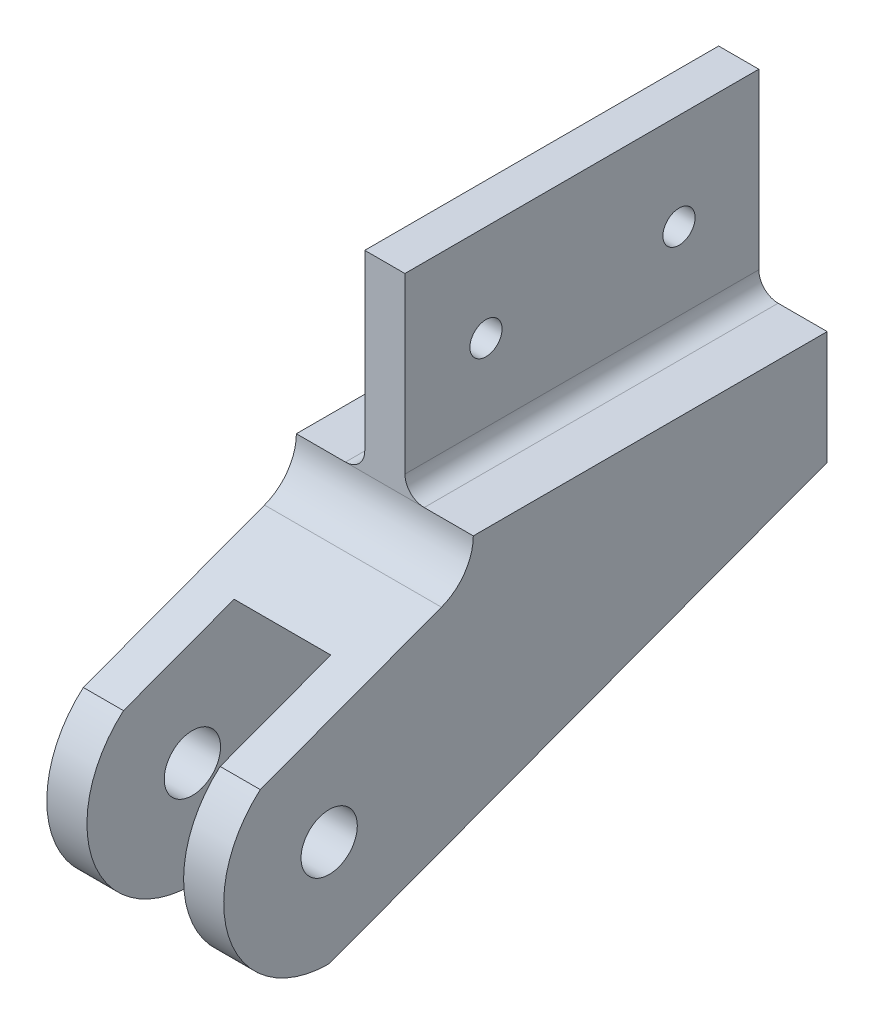
ISO-10303-21;
HEADER;
FILE_DESCRIPTION(('STEP AP214'),'2;1');
FILE_NAME('part.step','',(''),(''),'','','');
FILE_SCHEMA(('AUTOMOTIVE_DESIGN { 1 0 10303 214 1 1 1 1 }'));
ENDSEC;
DATA;
#1=APPLICATION_CONTEXT('core data for automotive mechanical design processes');
#2=APPLICATION_PROTOCOL_DEFINITION('international standard','automotive_design',2000,#1);
#3=PRODUCT_CONTEXT('',#1,'mechanical');
#4=PRODUCT('Part','Part','',(#3));
#5=PRODUCT_RELATED_PRODUCT_CATEGORY('part','',(#4));
#6=PRODUCT_DEFINITION_FORMATION('','',#4);
#7=PRODUCT_DEFINITION_CONTEXT('part definition',#1,'design');
#8=PRODUCT_DEFINITION('design','',#6,#7);
#9=PRODUCT_DEFINITION_SHAPE('','',#8);
#10=(LENGTH_UNIT() NAMED_UNIT(*) SI_UNIT(.MILLI.,.METRE.));
#11=(NAMED_UNIT(*) PLANE_ANGLE_UNIT() SI_UNIT($,.RADIAN.));
#12=(NAMED_UNIT(*) SI_UNIT($,.STERADIAN.) SOLID_ANGLE_UNIT());
#13=UNCERTAINTY_MEASURE_WITH_UNIT(LENGTH_MEASURE(1.E-05),#10,'distance_accuracy_value','');
#14=(GEOMETRIC_REPRESENTATION_CONTEXT(3) GLOBAL_UNCERTAINTY_ASSIGNED_CONTEXT((#13)) GLOBAL_UNIT_ASSIGNED_CONTEXT((#10,
#11,#12)) REPRESENTATION_CONTEXT('',''));
#15=CARTESIAN_POINT('',(0.,0.,0.));
#16=DIRECTION('',(0.,0.,1.));
#17=DIRECTION('',(1.,0.,0.));
#18=AXIS2_PLACEMENT_3D('',#15,#16,#17);
#19=CARTESIAN_POINT('',(3.9624,-52.324,0.));
#20=DIRECTION('',(0.,1.,0.));
#21=DIRECTION('',(0.,0.,1.));
#22=AXIS2_PLACEMENT_3D('',#19,#20,#21);
#23=PLANE('',#22);
#24=DIRECTION('',(-1.,0.,0.));
#25=VECTOR('',#24,1.);
#26=CARTESIAN_POINT('',(3.9624,-52.324,20.2080523722413));
#27=LINE('',#26,#25);
#28=CARTESIAN_POINT('',(9.5377,-52.324,20.2080523722413));
#29=VERTEX_POINT('',#28);
#30=CARTESIAN_POINT('',(-9.5377,-52.324,20.2080523722413));
#31=VERTEX_POINT('',#30);
#32=EDGE_CURVE('E298',#29,#31,#27,.T.);
#33=ORIENTED_EDGE('',*,*,#32,.T.);
#34=DIRECTION('',(0.,0.,-1.));
#35=VECTOR('',#34,1.);
#36=CARTESIAN_POINT('',(-9.5377,-52.324,0.));
#37=LINE('',#36,#35);
#38=CARTESIAN_POINT('',(-9.5377,-52.324,-69.85));
#39=VERTEX_POINT('',#38);
#40=EDGE_CURVE('E166',#31,#39,#37,.T.);
#41=ORIENTED_EDGE('',*,*,#40,.T.);
#42=DIRECTION('',(-1.,0.,0.));
#43=VECTOR('',#42,1.);
#44=CARTESIAN_POINT('',(3.9624,-52.324,-69.85));
#45=LINE('',#44,#43);
#46=CARTESIAN_POINT('',(9.5377,-52.324,-69.85));
#47=VERTEX_POINT('',#46);
#48=EDGE_CURVE('E290',#47,#39,#45,.T.);
#49=ORIENTED_EDGE('',*,*,#48,.F.);
#50=DIRECTION('',(0.,0.,-1.));
#51=VECTOR('',#50,1.);
#52=CARTESIAN_POINT('',(9.5377,-52.324,0.));
#53=LINE('',#52,#51);
#54=EDGE_CURVE('E198',#29,#47,#53,.T.);
#55=ORIENTED_EDGE('',*,*,#54,.F.);
#56=EDGE_LOOP('',(#33,#41,#49,#55));
#57=FACE_BOUND('',#56,.T.);
#58=ADVANCED_FACE('F35',(#57),#23,.F.);
#59=CARTESIAN_POINT('',(3.9624,0.,0.));
#60=DIRECTION('',(0.,0.,-1.));
#61=DIRECTION('',(0.,1.,0.));
#62=AXIS2_PLACEMENT_3D('',#59,#60,#61);
#63=PLANE('',#62);
#64=DIRECTION('',(0.,-1.,0.));
#65=VECTOR('',#64,1.);
#66=CARTESIAN_POINT('',(-3.9624,0.,0.));
#67=LINE('',#66,#65);
#68=CARTESIAN_POINT('',(-3.9624,0.,0.));
#69=VERTEX_POINT('',#68);
#70=CARTESIAN_POINT('',(-3.9624,-34.29,0.));
#71=VERTEX_POINT('',#70);
#72=EDGE_CURVE('E280',#69,#71,#67,.T.);
#73=ORIENTED_EDGE('',*,*,#72,.T.);
#74=CARTESIAN_POINT('',(-7.7724,-34.29,0.));
#75=DIRECTION('',(0.,0.,-1.));
#76=DIRECTION('',(0.,1.,0.));
#77=AXIS2_PLACEMENT_3D('',#74,#75,#76);
#78=CIRCLE('',#77,3.81);
#79=CARTESIAN_POINT('',(-7.7724,-38.1,0.));
#80=VERTEX_POINT('',#79);
#81=EDGE_CURVE('E219',#71,#80,#78,.T.);
#82=ORIENTED_EDGE('',*,*,#81,.T.);
#83=DIRECTION('',(-1.,0.,0.));
#84=VECTOR('',#83,1.);
#85=CARTESIAN_POINT('',(3.9624,-38.1,0.));
#86=LINE('',#85,#84);
#87=CARTESIAN_POINT('',(7.7724,-38.1,0.));
#88=VERTEX_POINT('',#87);
#89=EDGE_CURVE('E51',#88,#80,#86,.T.);
#90=ORIENTED_EDGE('',*,*,#89,.F.);
#91=CARTESIAN_POINT('',(7.7724,-34.29,0.));
#92=DIRECTION('',(0.,0.,-1.));
#93=DIRECTION('',(0.,1.,0.));
#94=AXIS2_PLACEMENT_3D('',#91,#92,#93);
#95=CIRCLE('',#94,3.81);
#96=CARTESIAN_POINT('',(3.9624,-34.29,0.));
#97=VERTEX_POINT('',#96);
#98=EDGE_CURVE('E44',#88,#97,#95,.T.);
#99=ORIENTED_EDGE('',*,*,#98,.T.);
#100=DIRECTION('',(0.,-1.,0.));
#101=VECTOR('',#100,1.);
#102=CARTESIAN_POINT('',(3.9624,0.,0.));
#103=LINE('',#102,#101);
#104=CARTESIAN_POINT('',(3.9624,0.,0.));
#105=VERTEX_POINT('',#104);
#106=EDGE_CURVE('E229',#105,#97,#103,.T.);
#107=ORIENTED_EDGE('',*,*,#106,.F.);
#108=DIRECTION('',(-1.,0.,0.));
#109=VECTOR('',#108,1.);
#110=CARTESIAN_POINT('',(3.9624,0.,0.));
#111=LINE('',#110,#109);
#112=EDGE_CURVE('E274',#105,#69,#111,.T.);
#113=ORIENTED_EDGE('',*,*,#112,.T.);
#114=EDGE_LOOP('',(#73,#82,#90,#99,#107,#113));
#115=FACE_BOUND('',#114,.T.);
#116=ADVANCED_FACE('F228',(#115),#63,.F.);
#117=CARTESIAN_POINT('',(3.9624,-38.1,9.65199999999999));
#118=DIRECTION('',(-1.,0.,0.));
#119=DIRECTION('',(0.,0.,1.));
#120=AXIS2_PLACEMENT_3D('',#117,#118,#119);
#121=CYLINDRICAL_SURFACE('',#120,9.652);
#122=ORIENTED_EDGE('',*,*,#89,.T.);
#123=DIRECTION('',(-1.,0.,0.));
#124=VECTOR('',#123,1.);
#125=CARTESIAN_POINT('',(17.4625,-38.1,0.));
#126=LINE('',#125,#124);
#127=CARTESIAN_POINT('',(-17.4625,-38.1,0.));
#128=VERTEX_POINT('',#127);
#129=EDGE_CURVE('E255',#80,#128,#126,.T.);
#130=ORIENTED_EDGE('',*,*,#129,.T.);
#131=CARTESIAN_POINT('',(-17.4625,-38.1,9.65199999999999));
#132=DIRECTION('',(1.,0.,0.));
#133=DIRECTION('',(0.,0.,-1.));
#134=AXIS2_PLACEMENT_3D('',#131,#132,#133);
#135=CIRCLE('',#134,9.652);
#136=CARTESIAN_POINT('',(-17.4625,-47.1465655171766,6.28736683374962));
#137=VERTEX_POINT('',#136);
#138=EDGE_CURVE('E317',#128,#137,#135,.F.);
#139=ORIENTED_EDGE('',*,*,#138,.T.);
#140=DIRECTION('',(-1.,0.,0.));
#141=VECTOR('',#140,1.);
#142=CARTESIAN_POINT('',(3.9624,-47.1465655171766,6.28736683374962));
#143=LINE('',#142,#141);
#144=CARTESIAN_POINT('',(17.4625,-47.1465655171766,6.28736683374962));
#145=VERTEX_POINT('',#144);
#146=EDGE_CURVE('E359',#145,#137,#143,.T.);
#147=ORIENTED_EDGE('',*,*,#146,.F.);
#148=CARTESIAN_POINT('',(17.4625,-38.1,9.65199999999999));
#149=DIRECTION('',(1.,0.,0.));
#150=DIRECTION('',(0.,0.,-1.));
#151=AXIS2_PLACEMENT_3D('',#148,#149,#150);
#152=CIRCLE('',#151,9.652);
#153=CARTESIAN_POINT('',(17.4625,-38.1,0.));
#154=VERTEX_POINT('',#153);
#155=EDGE_CURVE('E325',#154,#145,#152,.F.);
#156=ORIENTED_EDGE('',*,*,#155,.F.);
#157=EDGE_CURVE('E258',#154,#88,#126,.T.);
#158=ORIENTED_EDGE('',*,*,#157,.T.);
#159=EDGE_LOOP('',(#122,#130,#139,#147,#156,#158));
#160=FACE_BOUND('',#159,.T.);
#161=ADVANCED_FACE('F362',(#160),#121,.F.);
#162=CARTESIAN_POINT('',(3.9624,-39.3631454516726,-14.6400912548712));
#163=DIRECTION('',(0.,-0.937273675629564,-0.348594401807956));
#164=DIRECTION('',(0.,0.348594401807956,-0.937273675629564));
#165=AXIS2_PLACEMENT_3D('',#162,#163,#164);
#166=PLANE('',#165);
#167=ORIENTED_EDGE('',*,*,#146,.T.);
#168=DIRECTION('',(0.,-0.348594401807956,0.937273675629564));
#169=VECTOR('',#168,1.);
#170=CARTESIAN_POINT('',(-17.4625,-39.3631454516726,-14.6400912548712));
#171=LINE('',#170,#169);
#172=CARTESIAN_POINT('',(-17.4625,-60.4465465821321,42.0473276188397));
#173=VERTEX_POINT('',#172);
#174=EDGE_CURVE('E173',#137,#173,#171,.T.);
#175=ORIENTED_EDGE('',*,*,#174,.T.);
#176=DIRECTION('',(-1.,0.,0.));
#177=VECTOR('',#176,1.);
#178=CARTESIAN_POINT('',(-9.5377,-60.4465465821321,42.0473276188397));
#179=LINE('',#178,#177);
#180=CARTESIAN_POINT('',(-9.5377,-60.4465465821321,42.0473276188397));
#181=VERTEX_POINT('',#180);
#182=EDGE_CURVE('E154',#181,#173,#179,.T.);
#183=ORIENTED_EDGE('',*,*,#182,.F.);
#184=DIRECTION('',(0.,-0.348594401807956,0.937273675629564));
#185=VECTOR('',#184,1.);
#186=CARTESIAN_POINT('',(-9.5377,-39.3631454516726,-14.6400912548712));
#187=LINE('',#186,#185);
#188=EDGE_CURVE('E160',#31,#181,#187,.T.);
#189=ORIENTED_EDGE('',*,*,#188,.F.);
#190=ORIENTED_EDGE('',*,*,#32,.F.);
#191=DIRECTION('',(0.,-0.348594401807956,0.937273675629564));
#192=VECTOR('',#191,1.);
#193=CARTESIAN_POINT('',(9.5377,-39.3631454516726,-14.6400912548712));
#194=LINE('',#193,#192);
#195=CARTESIAN_POINT('',(9.5377,-60.4465465821321,42.0473276188397));
#196=VERTEX_POINT('',#195);
#197=EDGE_CURVE('E187',#29,#196,#194,.T.);
#198=ORIENTED_EDGE('',*,*,#197,.T.);
#199=DIRECTION('',(1.,0.,0.));
#200=VECTOR('',#199,1.);
#201=CARTESIAN_POINT('',(9.5377,-60.4465465821321,42.0473276188397));
#202=LINE('',#201,#200);
#203=CARTESIAN_POINT('',(17.4625,-60.4465465821321,42.0473276188397));
#204=VERTEX_POINT('',#203);
#205=EDGE_CURVE('E202',#196,#204,#202,.T.);
#206=ORIENTED_EDGE('',*,*,#205,.T.);
#207=DIRECTION('',(0.,-0.348594401807956,0.937273675629564));
#208=VECTOR('',#207,1.);
#209=CARTESIAN_POINT('',(17.4625,-39.3631454516726,-14.6400912548712));
#210=LINE('',#209,#208);
#211=EDGE_CURVE('E328',#145,#204,#210,.T.);
#212=ORIENTED_EDGE('',*,*,#211,.F.);
#213=EDGE_LOOP('',(#167,#175,#183,#189,#190,#198,#206,#212));
#214=FACE_BOUND('',#213,.T.);
#215=ADVANCED_FACE('F171',(#214),#166,.F.);
#216=CARTESIAN_POINT('',(3.9624,0.,-69.85));
#217=DIRECTION('',(0.,0.,-1.));
#218=DIRECTION('',(0.,1.,0.));
#219=AXIS2_PLACEMENT_3D('',#216,#217,#218);
#220=PLANE('',#219);
#221=DIRECTION('',(0.,-1.,0.));
#222=VECTOR('',#221,1.);
#223=CARTESIAN_POINT('',(3.9624,0.,-69.85));
#224=LINE('',#223,#222);
#225=CARTESIAN_POINT('',(3.9624,0.,-69.85));
#226=VERTEX_POINT('',#225);
#227=CARTESIAN_POINT('',(3.9624,-34.29,-69.85));
#228=VERTEX_POINT('',#227);
#229=EDGE_CURVE('E241',#226,#228,#224,.T.);
#230=ORIENTED_EDGE('',*,*,#229,.T.);
#231=CARTESIAN_POINT('',(7.7724,-34.29,-69.85));
#232=DIRECTION('',(0.,0.,-1.));
#233=DIRECTION('',(0.,1.,0.));
#234=AXIS2_PLACEMENT_3D('',#231,#232,#233);
#235=CIRCLE('',#234,3.81);
#236=CARTESIAN_POINT('',(7.7724,-38.1,-69.85));
#237=VERTEX_POINT('',#236);
#238=EDGE_CURVE('E11',#228,#237,#235,.F.);
#239=ORIENTED_EDGE('',*,*,#238,.T.);
#240=DIRECTION('',(-1.,0.,0.));
#241=VECTOR('',#240,1.);
#242=CARTESIAN_POINT('',(17.4625,-38.1,-69.85));
#243=LINE('',#242,#241);
#244=CARTESIAN_POINT('',(17.4625,-38.1,-69.85));
#245=VERTEX_POINT('',#244);
#246=EDGE_CURVE('E248',#245,#237,#243,.T.);
#247=ORIENTED_EDGE('',*,*,#246,.F.);
#248=DIRECTION('',(0.,-1.,0.));
#249=VECTOR('',#248,1.);
#250=CARTESIAN_POINT('',(17.4625,0.,-69.85));
#251=LINE('',#250,#249);
#252=CARTESIAN_POINT('',(17.4625,-60.452,-69.85));
#253=VERTEX_POINT('',#252);
#254=EDGE_CURVE('E260',#245,#253,#251,.T.);
#255=ORIENTED_EDGE('',*,*,#254,.T.);
#256=DIRECTION('',(1.,0.,0.));
#257=VECTOR('',#256,1.);
#258=CARTESIAN_POINT('',(9.5377,-60.452,-69.85));
#259=LINE('',#258,#257);
#260=CARTESIAN_POINT('',(9.5377,-60.452,-69.85));
#261=VERTEX_POINT('',#260);
#262=EDGE_CURVE('E309',#261,#253,#259,.T.);
#263=ORIENTED_EDGE('',*,*,#262,.F.);
#264=DIRECTION('',(0.,-1.,0.));
#265=VECTOR('',#264,1.);
#266=CARTESIAN_POINT('',(9.5377,0.,-69.85));
#267=LINE('',#266,#265);
#268=EDGE_CURVE('E194',#47,#261,#267,.T.);
#269=ORIENTED_EDGE('',*,*,#268,.F.);
#270=ORIENTED_EDGE('',*,*,#48,.T.);
#271=DIRECTION('',(0.,-1.,0.));
#272=VECTOR('',#271,1.);
#273=CARTESIAN_POINT('',(-9.5377,0.,-69.85));
#274=LINE('',#273,#272);
#275=CARTESIAN_POINT('',(-9.5377,-60.452,-69.85));
#276=VERTEX_POINT('',#275);
#277=EDGE_CURVE('E344',#39,#276,#274,.T.);
#278=ORIENTED_EDGE('',*,*,#277,.T.);
#279=DIRECTION('',(-1.,0.,0.));
#280=VECTOR('',#279,1.);
#281=CARTESIAN_POINT('',(-9.5377,-60.452,-69.85));
#282=LINE('',#281,#280);
#283=CARTESIAN_POINT('',(-17.4625,-60.452,-69.85));
#284=VERTEX_POINT('',#283);
#285=EDGE_CURVE('E180',#276,#284,#282,.T.);
#286=ORIENTED_EDGE('',*,*,#285,.T.);
#287=DIRECTION('',(0.,-1.,0.));
#288=VECTOR('',#287,1.);
#289=CARTESIAN_POINT('',(-17.4625,0.,-69.85));
#290=LINE('',#289,#288);
#291=CARTESIAN_POINT('',(-17.4625,-38.1,-69.85));
#292=VERTEX_POINT('',#291);
#293=EDGE_CURVE('E262',#292,#284,#290,.T.);
#294=ORIENTED_EDGE('',*,*,#293,.F.);
#295=CARTESIAN_POINT('',(-7.7724,-38.1,-69.85));
#296=VERTEX_POINT('',#295);
#297=EDGE_CURVE('E256',#296,#292,#243,.T.);
#298=ORIENTED_EDGE('',*,*,#297,.F.);
#299=CARTESIAN_POINT('',(-7.7724,-34.29,-69.85));
#300=DIRECTION('',(0.,0.,-1.));
#301=DIRECTION('',(0.,1.,0.));
#302=AXIS2_PLACEMENT_3D('',#299,#300,#301);
#303=CIRCLE('',#302,3.81);
#304=CARTESIAN_POINT('',(-3.9624,-34.29,-69.85));
#305=VERTEX_POINT('',#304);
#306=EDGE_CURVE('E222',#296,#305,#303,.F.);
#307=ORIENTED_EDGE('',*,*,#306,.T.);
#308=DIRECTION('',(0.,-1.,0.));
#309=VECTOR('',#308,1.);
#310=CARTESIAN_POINT('',(-3.9624,0.,-69.85));
#311=LINE('',#310,#309);
#312=CARTESIAN_POINT('',(-3.9624,0.,-69.85));
#313=VERTEX_POINT('',#312);
#314=EDGE_CURVE('E282',#313,#305,#311,.T.);
#315=ORIENTED_EDGE('',*,*,#314,.F.);
#316=DIRECTION('',(-1.,0.,0.));
#317=VECTOR('',#316,1.);
#318=CARTESIAN_POINT('',(3.9624,0.,-69.85));
#319=LINE('',#318,#317);
#320=EDGE_CURVE('E288',#226,#313,#319,.T.);
#321=ORIENTED_EDGE('',*,*,#320,.F.);
#322=EDGE_LOOP('',(#230,#239,#247,#255,#263,#269,#270,#278,#286,#294,#298,#307,#315,#321));
#323=FACE_BOUND('',#322,.T.);
#324=ADVANCED_FACE('F247',(#323),#220,.T.);
#325=CARTESIAN_POINT('',(3.9624,-19.05,-16.002));
#326=DIRECTION('',(-1.,0.,0.));
#327=DIRECTION('',(0.,0.,1.));
#328=AXIS2_PLACEMENT_3D('',#325,#326,#327);
#329=CYLINDRICAL_SURFACE('',#328,3.175);
#330=CARTESIAN_POINT('',(3.9624,-19.05,-16.002));
#331=DIRECTION('',(1.,0.,0.));
#332=DIRECTION('',(0.,0.,-1.));
#333=AXIS2_PLACEMENT_3D('',#330,#331,#332);
#334=CIRCLE('',#333,3.175);
#335=CARTESIAN_POINT('',(3.9624,-19.05,-19.177));
#336=VERTEX_POINT('',#335);
#337=EDGE_CURVE('E242',#336,#336,#334,.T.);
#338=ORIENTED_EDGE('',*,*,#337,.T.);
#339=EDGE_LOOP('',(#338));
#340=FACE_BOUND('',#339,.T.);
#341=CARTESIAN_POINT('',(-3.9624,-19.05,-16.002));
#342=DIRECTION('',(1.,0.,0.));
#343=DIRECTION('',(0.,0.,-1.));
#344=AXIS2_PLACEMENT_3D('',#341,#342,#343);
#345=CIRCLE('',#344,3.175);
#346=CARTESIAN_POINT('',(-3.9624,-19.05,-19.177));
#347=VERTEX_POINT('',#346);
#348=EDGE_CURVE('E277',#347,#347,#345,.T.);
#349=ORIENTED_EDGE('',*,*,#348,.F.);
#350=EDGE_LOOP('',(#349));
#351=FACE_BOUND('',#350,.T.);
#352=ADVANCED_FACE('F385',(#340,#351),#329,.F.);
#353=CARTESIAN_POINT('',(3.9624,-19.05,-54.102));
#354=DIRECTION('',(-1.,0.,0.));
#355=DIRECTION('',(0.,0.,1.));
#356=AXIS2_PLACEMENT_3D('',#353,#354,#355);
#357=CYLINDRICAL_SURFACE('',#356,3.175);
#358=CARTESIAN_POINT('',(3.9624,-19.05,-54.102));
#359=DIRECTION('',(1.,0.,0.));
#360=DIRECTION('',(0.,0.,-1.));
#361=AXIS2_PLACEMENT_3D('',#358,#359,#360);
#362=CIRCLE('',#361,3.175);
#363=CARTESIAN_POINT('',(3.9624,-19.05,-57.277));
#364=VERTEX_POINT('',#363);
#365=EDGE_CURVE('E266',#364,#364,#362,.T.);
#366=ORIENTED_EDGE('',*,*,#365,.T.);
#367=EDGE_LOOP('',(#366));
#368=FACE_BOUND('',#367,.T.);
#369=CARTESIAN_POINT('',(-3.9624,-19.05,-54.102));
#370=DIRECTION('',(1.,0.,0.));
#371=DIRECTION('',(0.,0.,-1.));
#372=AXIS2_PLACEMENT_3D('',#369,#370,#371);
#373=CIRCLE('',#372,3.175);
#374=CARTESIAN_POINT('',(-3.9624,-19.05,-57.277));
#375=VERTEX_POINT('',#374);
#376=EDGE_CURVE('E265',#375,#375,#373,.T.);
#377=ORIENTED_EDGE('',*,*,#376,.F.);
#378=EDGE_LOOP('',(#377));
#379=FACE_BOUND('',#378,.T.);
#380=ADVANCED_FACE('F378',(#368,#379),#357,.F.);
#381=CARTESIAN_POINT('',(3.9624,0.,0.));
#382=DIRECTION('',(0.,1.,0.));
#383=DIRECTION('',(0.,0.,1.));
#384=AXIS2_PLACEMENT_3D('',#381,#382,#383);
#385=PLANE('',#384);
#386=DIRECTION('',(0.,0.,-1.));
#387=VECTOR('',#386,1.);
#388=CARTESIAN_POINT('',(-3.9624,0.,0.));
#389=LINE('',#388,#387);
#390=EDGE_CURVE('E269',#69,#313,#389,.T.);
#391=ORIENTED_EDGE('',*,*,#390,.F.);
#392=ORIENTED_EDGE('',*,*,#112,.F.);
#393=DIRECTION('',(0.,0.,-1.));
#394=VECTOR('',#393,1.);
#395=CARTESIAN_POINT('',(3.9624,0.,0.));
#396=LINE('',#395,#394);
#397=EDGE_CURVE('E240',#105,#226,#396,.T.);
#398=ORIENTED_EDGE('',*,*,#397,.T.);
#399=ORIENTED_EDGE('',*,*,#320,.T.);
#400=EDGE_LOOP('',(#391,#392,#398,#399));
#401=FACE_BOUND('',#400,.T.);
#402=ADVANCED_FACE('F376',(#401),#385,.T.);
#403=CARTESIAN_POINT('',(3.9624,0.,0.));
#404=DIRECTION('',(1.,0.,0.));
#405=DIRECTION('',(0.,0.,-1.));
#406=AXIS2_PLACEMENT_3D('',#403,#404,#405);
#407=PLANE('',#406);
#408=ORIENTED_EDGE('',*,*,#106,.T.);
#409=DIRECTION('',(0.,0.,1.));
#410=VECTOR('',#409,1.);
#411=CARTESIAN_POINT('',(3.9624,-34.29,-69.85));
#412=LINE('',#411,#410);
#413=EDGE_CURVE('E217',#97,#228,#412,.F.);
#414=ORIENTED_EDGE('',*,*,#413,.T.);
#415=ORIENTED_EDGE('',*,*,#229,.F.);
#416=ORIENTED_EDGE('',*,*,#397,.F.);
#417=EDGE_LOOP('',(#408,#414,#415,#416));
#418=FACE_BOUND('',#417,.T.);
#419=ORIENTED_EDGE('',*,*,#365,.F.);
#420=EDGE_LOOP('',(#419));
#421=FACE_BOUND('',#420,.T.);
#422=ORIENTED_EDGE('',*,*,#337,.F.);
#423=EDGE_LOOP('',(#422));
#424=FACE_BOUND('',#423,.T.);
#425=ADVANCED_FACE('F235',(#418,#421,#424),#407,.T.);
#426=CARTESIAN_POINT('',(-3.9624,0.,0.));
#427=DIRECTION('',(1.,0.,0.));
#428=DIRECTION('',(0.,0.,-1.));
#429=AXIS2_PLACEMENT_3D('',#426,#427,#428);
#430=PLANE('',#429);
#431=ORIENTED_EDGE('',*,*,#376,.T.);
#432=EDGE_LOOP('',(#431));
#433=FACE_BOUND('',#432,.T.);
#434=ORIENTED_EDGE('',*,*,#348,.T.);
#435=EDGE_LOOP('',(#434));
#436=FACE_BOUND('',#435,.T.);
#437=ORIENTED_EDGE('',*,*,#314,.T.);
#438=DIRECTION('',(0.,0.,1.));
#439=VECTOR('',#438,1.);
#440=CARTESIAN_POINT('',(-3.9624,-34.29,0.));
#441=LINE('',#440,#439);
#442=EDGE_CURVE('E209',#305,#71,#441,.T.);
#443=ORIENTED_EDGE('',*,*,#442,.T.);
#444=ORIENTED_EDGE('',*,*,#72,.F.);
#445=ORIENTED_EDGE('',*,*,#390,.T.);
#446=EDGE_LOOP('',(#437,#443,#444,#445));
#447=FACE_BOUND('',#446,.T.);
#448=ADVANCED_FACE('F373',(#433,#436,#447),#430,.F.);
#449=CARTESIAN_POINT('',(-17.4625,0.,0.));
#450=DIRECTION('',(1.,0.,0.));
#451=DIRECTION('',(0.,0.,-1.));
#452=AXIS2_PLACEMENT_3D('',#449,#450,#451);
#453=PLANE('',#452);
#454=DIRECTION('',(0.,0.,-1.));
#455=VECTOR('',#454,1.);
#456=CARTESIAN_POINT('',(-17.4625,-38.1,0.));
#457=LINE('',#456,#455);
#458=EDGE_CURVE('E313',#128,#292,#457,.T.);
#459=ORIENTED_EDGE('',*,*,#458,.T.);
#460=ORIENTED_EDGE('',*,*,#293,.T.);
#461=DIRECTION('',(0.,-0.348594401807956,0.937273675629564));
#462=VECTOR('',#461,1.);
#463=CARTESIAN_POINT('',(-17.4625,-75.9279661065452,-28.2394188737109));
#464=LINE('',#463,#462);
#465=CARTESIAN_POINT('',(-17.4625,-97.0113672370047,28.448));
#466=VERTEX_POINT('',#465);
#467=EDGE_CURVE('E339',#284,#466,#464,.T.);
#468=ORIENTED_EDGE('',*,*,#467,.T.);
#469=CARTESIAN_POINT('',(-17.4625,-76.2,28.448));
#470=DIRECTION('',(1.,0.,0.));
#471=DIRECTION('',(0.,0.,-1.));
#472=AXIS2_PLACEMENT_3D('',#469,#470,#471);
#473=CIRCLE('',#472,20.8113672370047);
#474=EDGE_CURVE('E347',#173,#466,#473,.T.);
#475=ORIENTED_EDGE('',*,*,#474,.F.);
#476=ORIENTED_EDGE('',*,*,#174,.F.);
#477=ORIENTED_EDGE('',*,*,#138,.F.);
#478=EDGE_LOOP('',(#459,#460,#468,#475,#476,#477));
#479=FACE_BOUND('',#478,.T.);
#480=CARTESIAN_POINT('',(-17.4625,-76.2,28.448));
#481=DIRECTION('',(1.,0.,0.));
#482=DIRECTION('',(0.,0.,-1.));
#483=AXIS2_PLACEMENT_3D('',#480,#481,#482);
#484=CIRCLE('',#483,5.55625);
#485=CARTESIAN_POINT('',(-17.4625,-76.2,22.89175));
#486=VERTEX_POINT('',#485);
#487=EDGE_CURVE('E351',#486,#486,#484,.T.);
#488=ORIENTED_EDGE('',*,*,#487,.T.);
#489=EDGE_LOOP('',(#488));
#490=FACE_BOUND('',#489,.T.);
#491=ADVANCED_FACE('F336',(#479,#490),#453,.F.);
#492=CARTESIAN_POINT('',(17.4625,-38.1,0.));
#493=DIRECTION('',(0.,1.,0.));
#494=DIRECTION('',(0.,0.,1.));
#495=AXIS2_PLACEMENT_3D('',#492,#493,#494);
#496=PLANE('',#495);
#497=ORIENTED_EDGE('',*,*,#129,.F.);
#498=DIRECTION('',(0.,0.,1.));
#499=VECTOR('',#498,1.);
#500=CARTESIAN_POINT('',(-7.7724,-38.1,0.));
#501=LINE('',#500,#499);
#502=EDGE_CURVE('E212',#80,#296,#501,.F.);
#503=ORIENTED_EDGE('',*,*,#502,.T.);
#504=ORIENTED_EDGE('',*,*,#297,.T.);
#505=ORIENTED_EDGE('',*,*,#458,.F.);
#506=EDGE_LOOP('',(#497,#503,#504,#505));
#507=FACE_BOUND('',#506,.T.);
#508=ADVANCED_FACE('F364',(#507),#496,.T.);
#509=ORIENTED_EDGE('',*,*,#246,.T.);
#510=DIRECTION('',(0.,0.,1.));
#511=VECTOR('',#510,1.);
#512=CARTESIAN_POINT('',(7.7724,-38.1,0.));
#513=LINE('',#512,#511);
#514=EDGE_CURVE('E214',#237,#88,#513,.T.);
#515=ORIENTED_EDGE('',*,*,#514,.T.);
#516=ORIENTED_EDGE('',*,*,#157,.F.);
#517=DIRECTION('',(0.,0.,-1.));
#518=VECTOR('',#517,1.);
#519=CARTESIAN_POINT('',(17.4625,-38.1,0.));
#520=LINE('',#519,#518);
#521=EDGE_CURVE('E253',#154,#245,#520,.T.);
#522=ORIENTED_EDGE('',*,*,#521,.T.);
#523=EDGE_LOOP('',(#509,#515,#516,#522));
#524=FACE_BOUND('',#523,.T.);
#525=ADVANCED_FACE('F251',(#524),#496,.T.);
#526=CARTESIAN_POINT('',(17.4625,0.,0.));
#527=DIRECTION('',(1.,0.,0.));
#528=DIRECTION('',(0.,0.,-1.));
#529=AXIS2_PLACEMENT_3D('',#526,#527,#528);
#530=PLANE('',#529);
#531=ORIENTED_EDGE('',*,*,#521,.F.);
#532=ORIENTED_EDGE('',*,*,#155,.T.);
#533=ORIENTED_EDGE('',*,*,#211,.T.);
#534=CARTESIAN_POINT('',(17.4625,-76.2,28.448));
#535=DIRECTION('',(1.,0.,0.));
#536=DIRECTION('',(0.,0.,-1.));
#537=AXIS2_PLACEMENT_3D('',#534,#535,#536);
#538=CIRCLE('',#537,20.8113672370047);
#539=CARTESIAN_POINT('',(17.4625,-97.0113672370047,28.448));
#540=VERTEX_POINT('',#539);
#541=EDGE_CURVE('E178',#204,#540,#538,.T.);
#542=ORIENTED_EDGE('',*,*,#541,.T.);
#543=DIRECTION('',(0.,-0.348594401807956,0.937273675629564));
#544=VECTOR('',#543,1.);
#545=CARTESIAN_POINT('',(17.4625,-75.9279661065452,-28.2394188737109));
#546=LINE('',#545,#544);
#547=EDGE_CURVE('E188',#253,#540,#546,.T.);
#548=ORIENTED_EDGE('',*,*,#547,.F.);
#549=ORIENTED_EDGE('',*,*,#254,.F.);
#550=EDGE_LOOP('',(#531,#532,#533,#542,#548,#549));
#551=FACE_BOUND('',#550,.T.);
#552=CARTESIAN_POINT('',(17.4625,-76.2,28.448));
#553=DIRECTION('',(1.,0.,0.));
#554=DIRECTION('',(0.,0.,-1.));
#555=AXIS2_PLACEMENT_3D('',#552,#553,#554);
#556=CIRCLE('',#555,5.55625);
#557=CARTESIAN_POINT('',(17.4625,-76.2,22.89175));
#558=VERTEX_POINT('',#557);
#559=EDGE_CURVE('E175',#558,#558,#556,.T.);
#560=ORIENTED_EDGE('',*,*,#559,.F.);
#561=EDGE_LOOP('',(#560));
#562=FACE_BOUND('',#561,.T.);
#563=ADVANCED_FACE('F430',(#551,#562),#530,.T.);
#564=CARTESIAN_POINT('',(9.5377,-75.9279661065452,-28.2394188737109));
#565=DIRECTION('',(0.,0.937273675629564,0.348594401807956));
#566=DIRECTION('',(0.,-0.348594401807956,0.937273675629564));
#567=AXIS2_PLACEMENT_3D('',#564,#565,#566);
#568=PLANE('',#567);
#569=ORIENTED_EDGE('',*,*,#547,.T.);
#570=DIRECTION('',(1.,0.,0.));
#571=VECTOR('',#570,1.);
#572=CARTESIAN_POINT('',(9.5377,-97.0113672370047,28.448));
#573=LINE('',#572,#571);
#574=CARTESIAN_POINT('',(9.5377,-97.0113672370047,28.448));
#575=VERTEX_POINT('',#574);
#576=EDGE_CURVE('E314',#575,#540,#573,.T.);
#577=ORIENTED_EDGE('',*,*,#576,.F.);
#578=DIRECTION('',(0.,-0.348594401807956,0.937273675629564));
#579=VECTOR('',#578,1.);
#580=CARTESIAN_POINT('',(9.5377,-75.9279661065452,-28.2394188737109));
#581=LINE('',#580,#579);
#582=EDGE_CURVE('E192',#261,#575,#581,.T.);
#583=ORIENTED_EDGE('',*,*,#582,.F.);
#584=ORIENTED_EDGE('',*,*,#262,.T.);
#585=EDGE_LOOP('',(#569,#577,#583,#584));
#586=FACE_BOUND('',#585,.T.);
#587=ADVANCED_FACE('F426',(#586),#568,.F.);
#588=CARTESIAN_POINT('',(9.5377,-76.2,28.448));
#589=DIRECTION('',(1.,0.,0.));
#590=DIRECTION('',(0.,0.,-1.));
#591=AXIS2_PLACEMENT_3D('',#588,#589,#590);
#592=CYLINDRICAL_SURFACE('',#591,5.55625);
#593=CARTESIAN_POINT('',(9.5377,-76.2,28.448));
#594=DIRECTION('',(1.,0.,0.));
#595=DIRECTION('',(0.,0.,-1.));
#596=AXIS2_PLACEMENT_3D('',#593,#594,#595);
#597=CIRCLE('',#596,5.55625);
#598=CARTESIAN_POINT('',(9.5377,-76.2,22.89175));
#599=VERTEX_POINT('',#598);
#600=EDGE_CURVE('E184',#599,#599,#597,.T.);
#601=ORIENTED_EDGE('',*,*,#600,.F.);
#602=EDGE_LOOP('',(#601));
#603=FACE_BOUND('',#602,.T.);
#604=ORIENTED_EDGE('',*,*,#559,.T.);
#605=EDGE_LOOP('',(#604));
#606=FACE_BOUND('',#605,.T.);
#607=ADVANCED_FACE('F429',(#603,#606),#592,.F.);
#608=CARTESIAN_POINT('',(9.5377,-76.2,28.448));
#609=DIRECTION('',(1.,0.,0.));
#610=DIRECTION('',(0.,0.,-1.));
#611=AXIS2_PLACEMENT_3D('',#608,#609,#610);
#612=CYLINDRICAL_SURFACE('',#611,20.8113672370047);
#613=ORIENTED_EDGE('',*,*,#541,.F.);
#614=ORIENTED_EDGE('',*,*,#205,.F.);
#615=CARTESIAN_POINT('',(9.5377,-76.2,28.448));
#616=DIRECTION('',(1.,0.,0.));
#617=DIRECTION('',(0.,0.,-1.));
#618=AXIS2_PLACEMENT_3D('',#615,#616,#617);
#619=CIRCLE('',#618,20.8113672370047);
#620=EDGE_CURVE('E189',#196,#575,#619,.T.);
#621=ORIENTED_EDGE('',*,*,#620,.T.);
#622=ORIENTED_EDGE('',*,*,#576,.T.);
#623=EDGE_LOOP('',(#613,#614,#621,#622));
#624=FACE_BOUND('',#623,.T.);
#625=ADVANCED_FACE('F424',(#624),#612,.T.);
#626=CARTESIAN_POINT('',(9.5377,0.,0.));
#627=DIRECTION('',(1.,0.,0.));
#628=DIRECTION('',(0.,0.,-1.));
#629=AXIS2_PLACEMENT_3D('',#626,#627,#628);
#630=PLANE('',#629);
#631=ORIENTED_EDGE('',*,*,#600,.T.);
#632=EDGE_LOOP('',(#631));
#633=FACE_BOUND('',#632,.T.);
#634=ORIENTED_EDGE('',*,*,#197,.F.);
#635=ORIENTED_EDGE('',*,*,#54,.T.);
#636=ORIENTED_EDGE('',*,*,#268,.T.);
#637=ORIENTED_EDGE('',*,*,#582,.T.);
#638=ORIENTED_EDGE('',*,*,#620,.F.);
#639=EDGE_LOOP('',(#634,#635,#636,#637,#638));
#640=FACE_BOUND('',#639,.T.);
#641=ADVANCED_FACE('F305',(#633,#640),#630,.F.);
#642=CARTESIAN_POINT('',(-9.5377,-76.2,28.448));
#643=DIRECTION('',(-1.,0.,0.));
#644=DIRECTION('',(0.,0.,1.));
#645=AXIS2_PLACEMENT_3D('',#642,#643,#644);
#646=CYLINDRICAL_SURFACE('',#645,20.8113672370047);
#647=ORIENTED_EDGE('',*,*,#474,.T.);
#648=DIRECTION('',(-1.,0.,0.));
#649=VECTOR('',#648,1.);
#650=CARTESIAN_POINT('',(-9.5377,-97.0113672370047,28.448));
#651=LINE('',#650,#649);
#652=CARTESIAN_POINT('',(-9.5377,-97.0113672370047,28.448));
#653=VERTEX_POINT('',#652);
#654=EDGE_CURVE('E155',#653,#466,#651,.T.);
#655=ORIENTED_EDGE('',*,*,#654,.F.);
#656=CARTESIAN_POINT('',(-9.5377,-76.2,28.448));
#657=DIRECTION('',(1.,0.,0.));
#658=DIRECTION('',(0.,0.,-1.));
#659=AXIS2_PLACEMENT_3D('',#656,#657,#658);
#660=CIRCLE('',#659,20.8113672370047);
#661=EDGE_CURVE('E149',#181,#653,#660,.T.);
#662=ORIENTED_EDGE('',*,*,#661,.F.);
#663=ORIENTED_EDGE('',*,*,#182,.T.);
#664=EDGE_LOOP('',(#647,#655,#662,#663));
#665=FACE_BOUND('',#664,.T.);
#666=ADVANCED_FACE('F152',(#665),#646,.T.);
#667=CARTESIAN_POINT('',(-9.5377,-75.9279661065452,-28.2394188737109));
#668=DIRECTION('',(0.,-0.937273675629564,-0.348594401807956));
#669=DIRECTION('',(0.,0.348594401807956,-0.937273675629564));
#670=AXIS2_PLACEMENT_3D('',#667,#668,#669);
#671=PLANE('',#670);
#672=ORIENTED_EDGE('',*,*,#467,.F.);
#673=ORIENTED_EDGE('',*,*,#285,.F.);
#674=DIRECTION('',(0.,-0.348594401807956,0.937273675629564));
#675=VECTOR('',#674,1.);
#676=CARTESIAN_POINT('',(-9.5377,-75.9279661065452,-28.2394188737109));
#677=LINE('',#676,#675);
#678=EDGE_CURVE('E159',#276,#653,#677,.T.);
#679=ORIENTED_EDGE('',*,*,#678,.T.);
#680=ORIENTED_EDGE('',*,*,#654,.T.);
#681=EDGE_LOOP('',(#672,#673,#679,#680));
#682=FACE_BOUND('',#681,.T.);
#683=ADVANCED_FACE('F346',(#682),#671,.T.);
#684=CARTESIAN_POINT('',(-9.5377,-76.2,28.448));
#685=DIRECTION('',(-1.,0.,0.));
#686=DIRECTION('',(0.,0.,1.));
#687=AXIS2_PLACEMENT_3D('',#684,#685,#686);
#688=CYLINDRICAL_SURFACE('',#687,5.55625);
#689=CARTESIAN_POINT('',(-9.5377,-76.2,28.448));
#690=DIRECTION('',(1.,0.,0.));
#691=DIRECTION('',(0.,0.,-1.));
#692=AXIS2_PLACEMENT_3D('',#689,#690,#691);
#693=CIRCLE('',#692,5.55625);
#694=CARTESIAN_POINT('',(-9.5377,-76.2,22.89175));
#695=VERTEX_POINT('',#694);
#696=EDGE_CURVE('E169',#695,#695,#693,.T.);
#697=ORIENTED_EDGE('',*,*,#696,.T.);
#698=EDGE_LOOP('',(#697));
#699=FACE_BOUND('',#698,.T.);
#700=ORIENTED_EDGE('',*,*,#487,.F.);
#701=EDGE_LOOP('',(#700));
#702=FACE_BOUND('',#701,.T.);
#703=ADVANCED_FACE('F408',(#699,#702),#688,.F.);
#704=CARTESIAN_POINT('',(-9.5377,0.,0.));
#705=DIRECTION('',(1.,0.,0.));
#706=DIRECTION('',(0.,0.,-1.));
#707=AXIS2_PLACEMENT_3D('',#704,#705,#706);
#708=PLANE('',#707);
#709=ORIENTED_EDGE('',*,*,#696,.F.);
#710=EDGE_LOOP('',(#709));
#711=FACE_BOUND('',#710,.T.);
#712=ORIENTED_EDGE('',*,*,#188,.T.);
#713=ORIENTED_EDGE('',*,*,#661,.T.);
#714=ORIENTED_EDGE('',*,*,#678,.F.);
#715=ORIENTED_EDGE('',*,*,#277,.F.);
#716=ORIENTED_EDGE('',*,*,#40,.F.);
#717=EDGE_LOOP('',(#712,#713,#714,#715,#716));
#718=FACE_BOUND('',#717,.T.);
#719=ADVANCED_FACE('F164',(#711,#718),#708,.T.);
#720=CARTESIAN_POINT('',(-7.7724,-34.29,0.));
#721=DIRECTION('',(0.,0.,1.));
#722=DIRECTION('',(1.,0.,0.));
#723=AXIS2_PLACEMENT_3D('',#720,#721,#722);
#724=CYLINDRICAL_SURFACE('',#723,3.81);
#725=ORIENTED_EDGE('',*,*,#306,.F.);
#726=ORIENTED_EDGE('',*,*,#502,.F.);
#727=ORIENTED_EDGE('',*,*,#81,.F.);
#728=ORIENTED_EDGE('',*,*,#442,.F.);
#729=EDGE_LOOP('',(#725,#726,#727,#728));
#730=FACE_BOUND('',#729,.T.);
#731=ADVANCED_FACE('F370',(#730),#724,.F.);
#732=CARTESIAN_POINT('',(7.7724,-34.29,0.));
#733=DIRECTION('',(0.,0.,-1.));
#734=DIRECTION('',(-1.,0.,0.));
#735=AXIS2_PLACEMENT_3D('',#732,#733,#734);
#736=CYLINDRICAL_SURFACE('',#735,3.81);
#737=ORIENTED_EDGE('',*,*,#238,.F.);
#738=ORIENTED_EDGE('',*,*,#413,.F.);
#739=ORIENTED_EDGE('',*,*,#98,.F.);
#740=ORIENTED_EDGE('',*,*,#514,.F.);
#741=EDGE_LOOP('',(#737,#738,#739,#740));
#742=FACE_BOUND('',#741,.T.);
#743=ADVANCED_FACE('F37',(#742),#736,.F.);
#744=CLOSED_SHELL('',(#58,#116,#161,#215,#324,#352,#380,#402,#425,#448,#491,#508,#525,#563,#587,
#607,#625,#641,#666,#683,#703,#719,#731,#743));
#745=MANIFOLD_SOLID_BREP('B2',#744);
#746=ADVANCED_BREP_SHAPE_REPRESENTATION('',(#18,#745),#14);
#747=SHAPE_DEFINITION_REPRESENTATION(#9,#746);
ENDSEC;
END-ISO-10303-21;
